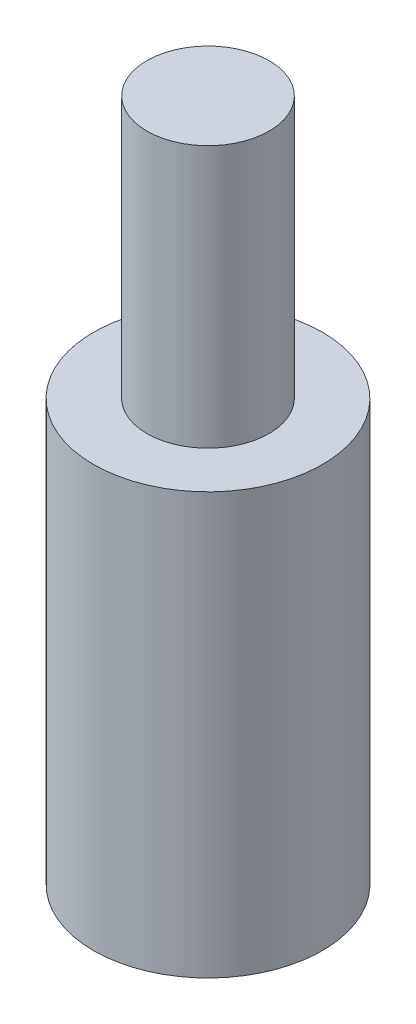
ISO-10303-21;
HEADER;
FILE_DESCRIPTION(('STEP AP214'),'2;1');
FILE_NAME('part.step','',(''),(''),'','','');
FILE_SCHEMA(('AUTOMOTIVE_DESIGN { 1 0 10303 214 1 1 1 1 }'));
ENDSEC;
DATA;
#1=APPLICATION_CONTEXT('core data for automotive mechanical design processes');
#2=APPLICATION_PROTOCOL_DEFINITION('international standard','automotive_design',2000,#1);
#3=PRODUCT_CONTEXT('',#1,'mechanical');
#4=PRODUCT('Part','Part','',(#3));
#5=PRODUCT_RELATED_PRODUCT_CATEGORY('part','',(#4));
#6=PRODUCT_DEFINITION_FORMATION('','',#4);
#7=PRODUCT_DEFINITION_CONTEXT('part definition',#1,'design');
#8=PRODUCT_DEFINITION('design','',#6,#7);
#9=PRODUCT_DEFINITION_SHAPE('','',#8);
#10=(LENGTH_UNIT() NAMED_UNIT(*) SI_UNIT(.MILLI.,.METRE.));
#11=(NAMED_UNIT(*) PLANE_ANGLE_UNIT() SI_UNIT($,.RADIAN.));
#12=(NAMED_UNIT(*) SI_UNIT($,.STERADIAN.) SOLID_ANGLE_UNIT());
#13=UNCERTAINTY_MEASURE_WITH_UNIT(LENGTH_MEASURE(1.E-05),#10,'distance_accuracy_value','');
#14=(GEOMETRIC_REPRESENTATION_CONTEXT(3) GLOBAL_UNCERTAINTY_ASSIGNED_CONTEXT((#13)) GLOBAL_UNIT_ASSIGNED_CONTEXT((#10,
#11,#12)) REPRESENTATION_CONTEXT('',''));
#15=CARTESIAN_POINT('',(0.,0.,0.));
#16=DIRECTION('',(0.,0.,1.));
#17=DIRECTION('',(1.,0.,0.));
#18=AXIS2_PLACEMENT_3D('',#15,#16,#17);
#19=CARTESIAN_POINT('',(0.,0.,0.));
#20=DIRECTION('',(0.,-1.,0.));
#21=DIRECTION('',(0.,0.,-1.));
#22=AXIS2_PLACEMENT_3D('',#19,#20,#21);
#23=PLANE('',#22);
#24=CARTESIAN_POINT('',(0.,0.,0.));
#25=DIRECTION('',(0.,1.,0.));
#26=DIRECTION('',(0.,0.,1.));
#27=AXIS2_PLACEMENT_3D('',#24,#25,#26);
#28=CIRCLE('',#27,7.5);
#29=CARTESIAN_POINT('',(0.,0.,7.5));
#30=VERTEX_POINT('',#29);
#31=EDGE_CURVE('E10',#30,#30,#28,.T.);
#32=ORIENTED_EDGE('',*,*,#31,.F.);
#33=EDGE_LOOP('',(#32));
#34=FACE_BOUND('',#33,.T.);
#35=ADVANCED_FACE('F31',(#34),#23,.T.);
#36=CARTESIAN_POINT('',(0.,55.9448905109489,0.));
#37=DIRECTION('',(0.,1.,0.));
#38=DIRECTION('',(0.,0.,1.));
#39=AXIS2_PLACEMENT_3D('',#36,#37,#38);
#40=CYLINDRICAL_SURFACE('',#39,7.5);
#41=ORIENTED_EDGE('',*,*,#31,.T.);
#42=EDGE_LOOP('',(#41));
#43=FACE_BOUND('',#42,.T.);
#44=CARTESIAN_POINT('',(0.,27.5784671532847,0.));
#45=DIRECTION('',(0.,1.,0.));
#46=DIRECTION('',(0.,0.,1.));
#47=AXIS2_PLACEMENT_3D('',#44,#45,#46);
#48=CIRCLE('',#47,7.5);
#49=CARTESIAN_POINT('',(0.,27.5784671532847,7.5));
#50=VERTEX_POINT('',#49);
#51=EDGE_CURVE('E37',#50,#50,#48,.T.);
#52=ORIENTED_EDGE('',*,*,#51,.F.);
#53=EDGE_LOOP('',(#52));
#54=FACE_BOUND('',#53,.T.);
#55=ADVANCED_FACE('F63',(#43,#54),#40,.T.);
#56=CARTESIAN_POINT('',(-7.5,27.5784671532847,0.));
#57=DIRECTION('',(0.,1.,0.));
#58=DIRECTION('',(0.,0.,1.));
#59=AXIS2_PLACEMENT_3D('',#56,#57,#58);
#60=PLANE('',#59);
#61=ORIENTED_EDGE('',*,*,#51,.T.);
#62=EDGE_LOOP('',(#61));
#63=FACE_BOUND('',#62,.T.);
#64=CARTESIAN_POINT('',(0.,27.5784671532847,0.));
#65=DIRECTION('',(0.,1.,0.));
#66=DIRECTION('',(0.,0.,1.));
#67=AXIS2_PLACEMENT_3D('',#64,#65,#66);
#68=CIRCLE('',#67,4.);
#69=CARTESIAN_POINT('',(0.,27.5784671532847,4.));
#70=VERTEX_POINT('',#69);
#71=EDGE_CURVE('E41',#70,#70,#68,.T.);
#72=ORIENTED_EDGE('',*,*,#71,.F.);
#73=EDGE_LOOP('',(#72));
#74=FACE_BOUND('',#73,.T.);
#75=ADVANCED_FACE('F55',(#63,#74),#60,.T.);
#76=CARTESIAN_POINT('',(0.,55.9448905109489,0.));
#77=DIRECTION('',(0.,1.,0.));
#78=DIRECTION('',(0.,0.,1.));
#79=AXIS2_PLACEMENT_3D('',#76,#77,#78);
#80=CYLINDRICAL_SURFACE('',#79,4.);
#81=ORIENTED_EDGE('',*,*,#71,.T.);
#82=EDGE_LOOP('',(#81));
#83=FACE_BOUND('',#82,.T.);
#84=CARTESIAN_POINT('',(0.,44.738402270884,0.));
#85=DIRECTION('',(0.,1.,0.));
#86=DIRECTION('',(0.,0.,1.));
#87=AXIS2_PLACEMENT_3D('',#84,#85,#86);
#88=CIRCLE('',#87,4.);
#89=CARTESIAN_POINT('',(0.,44.738402270884,4.));
#90=VERTEX_POINT('',#89);
#91=EDGE_CURVE('E45',#90,#90,#88,.T.);
#92=ORIENTED_EDGE('',*,*,#91,.F.);
#93=EDGE_LOOP('',(#92));
#94=FACE_BOUND('',#93,.T.);
#95=ADVANCED_FACE('F53',(#83,#94),#80,.T.);
#96=CARTESIAN_POINT('',(-4.,44.738402270884,0.));
#97=DIRECTION('',(0.,1.,0.));
#98=DIRECTION('',(0.,0.,1.));
#99=AXIS2_PLACEMENT_3D('',#96,#97,#98);
#100=PLANE('',#99);
#101=ORIENTED_EDGE('',*,*,#91,.T.);
#102=EDGE_LOOP('',(#101));
#103=FACE_BOUND('',#102,.T.);
#104=ADVANCED_FACE('F51',(#103),#100,.T.);
#105=CLOSED_SHELL('',(#35,#55,#75,#95,#104));
#106=MANIFOLD_SOLID_BREP('B2',#105);
#107=ADVANCED_BREP_SHAPE_REPRESENTATION('',(#18,#106),#14);
#108=SHAPE_DEFINITION_REPRESENTATION(#9,#107);
ENDSEC;
END-ISO-10303-21;
